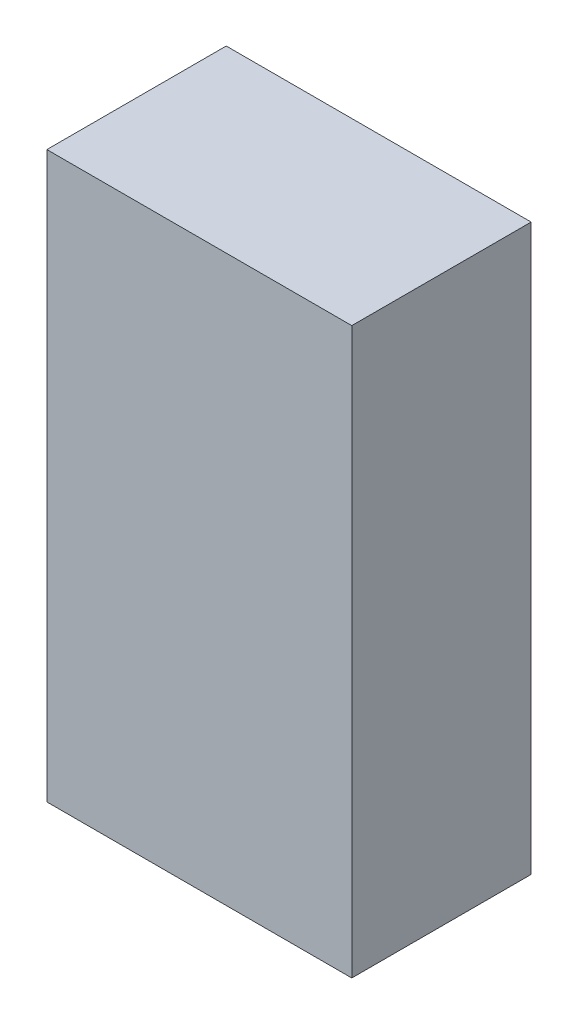
ISO-10303-21;
HEADER;
FILE_DESCRIPTION(('STEP AP214'),'2;1');
FILE_NAME('part.step','',(''),(''),'','','');
FILE_SCHEMA(('AUTOMOTIVE_DESIGN { 1 0 10303 214 1 1 1 1 }'));
ENDSEC;
DATA;
#1=APPLICATION_CONTEXT('core data for automotive mechanical design processes');
#2=APPLICATION_PROTOCOL_DEFINITION('international standard','automotive_design',2000,#1);
#3=PRODUCT_CONTEXT('',#1,'mechanical');
#4=PRODUCT('Part','Part','',(#3));
#5=PRODUCT_RELATED_PRODUCT_CATEGORY('part','',(#4));
#6=PRODUCT_DEFINITION_FORMATION('','',#4);
#7=PRODUCT_DEFINITION_CONTEXT('part definition',#1,'design');
#8=PRODUCT_DEFINITION('design','',#6,#7);
#9=PRODUCT_DEFINITION_SHAPE('','',#8);
#10=(LENGTH_UNIT() NAMED_UNIT(*) SI_UNIT(.MILLI.,.METRE.));
#11=(NAMED_UNIT(*) PLANE_ANGLE_UNIT() SI_UNIT($,.RADIAN.));
#12=(NAMED_UNIT(*) SI_UNIT($,.STERADIAN.) SOLID_ANGLE_UNIT());
#13=UNCERTAINTY_MEASURE_WITH_UNIT(LENGTH_MEASURE(1.E-05),#10,'distance_accuracy_value','');
#14=(GEOMETRIC_REPRESENTATION_CONTEXT(3) GLOBAL_UNCERTAINTY_ASSIGNED_CONTEXT((#13)) GLOBAL_UNIT_ASSIGNED_CONTEXT((#10,
#11,#12)) REPRESENTATION_CONTEXT('',''));
#15=CARTESIAN_POINT('',(0.,0.,0.));
#16=DIRECTION('',(0.,0.,1.));
#17=DIRECTION('',(1.,0.,0.));
#18=AXIS2_PLACEMENT_3D('',#15,#16,#17);
#19=CARTESIAN_POINT('',(-0.42500042,0.7875016,0.499999));
#20=DIRECTION('',(0.,0.,1.));
#21=DIRECTION('',(1.,0.,0.));
#22=AXIS2_PLACEMENT_3D('',#19,#20,#21);
#23=PLANE('',#22);
#24=DIRECTION('',(0.,1.,0.));
#25=VECTOR('',#24,1.);
#26=CARTESIAN_POINT('',(0.42500042,0.7875016,0.499999));
#27=LINE('',#26,#25);
#28=CARTESIAN_POINT('',(0.42500042,0.7875016,0.499999));
#29=VERTEX_POINT('',#28);
#30=CARTESIAN_POINT('',(0.42500042,-0.78749906,0.499999));
#31=VERTEX_POINT('',#30);
#32=EDGE_CURVE('E53',#29,#31,#27,.F.);
#33=ORIENTED_EDGE('',*,*,#32,.F.);
#34=DIRECTION('',(1.,0.,0.));
#35=VECTOR('',#34,1.);
#36=CARTESIAN_POINT('',(-0.42500042,0.7875016,0.499999));
#37=LINE('',#36,#35);
#38=CARTESIAN_POINT('',(-0.42500042,0.7875016,0.499999));
#39=VERTEX_POINT('',#38);
#40=EDGE_CURVE('E68',#39,#29,#37,.T.);
#41=ORIENTED_EDGE('',*,*,#40,.F.);
#42=DIRECTION('',(0.,1.,0.));
#43=VECTOR('',#42,1.);
#44=CARTESIAN_POINT('',(-0.42500042,-0.78749906,0.499999));
#45=LINE('',#44,#43);
#46=CARTESIAN_POINT('',(-0.42500042,-0.78749906,0.499999));
#47=VERTEX_POINT('',#46);
#48=EDGE_CURVE('E20',#47,#39,#45,.T.);
#49=ORIENTED_EDGE('',*,*,#48,.F.);
#50=DIRECTION('',(1.,0.,0.));
#51=VECTOR('',#50,1.);
#52=CARTESIAN_POINT('',(0.42500042,-0.78749906,0.499999));
#53=LINE('',#52,#51);
#54=EDGE_CURVE('E58',#31,#47,#53,.F.);
#55=ORIENTED_EDGE('',*,*,#54,.F.);
#56=EDGE_LOOP('',(#33,#41,#49,#55));
#57=FACE_BOUND('',#56,.T.);
#58=ADVANCED_FACE('F17',(#57),#23,.T.);
#59=CARTESIAN_POINT('',(-0.42500042,-0.78749906,0.));
#60=DIRECTION('',(-1.,0.,0.));
#61=DIRECTION('',(0.,0.,1.));
#62=AXIS2_PLACEMENT_3D('',#59,#60,#61);
#63=PLANE('',#62);
#64=DIRECTION('',(0.,0.,1.));
#65=VECTOR('',#64,1.);
#66=CARTESIAN_POINT('',(-0.42500042,0.7875016,0.));
#67=LINE('',#66,#65);
#68=CARTESIAN_POINT('',(-0.42500042,0.7875016,0.));
#69=VERTEX_POINT('',#68);
#70=EDGE_CURVE('E79',#69,#39,#67,.T.);
#71=ORIENTED_EDGE('',*,*,#70,.F.);
#72=DIRECTION('',(0.,1.,0.));
#73=VECTOR('',#72,1.);
#74=CARTESIAN_POINT('',(-0.42500042,0.7875016,0.));
#75=LINE('',#74,#73);
#76=CARTESIAN_POINT('',(-0.42500042,-0.78749906,0.));
#77=VERTEX_POINT('',#76);
#78=EDGE_CURVE('E74',#69,#77,#75,.F.);
#79=ORIENTED_EDGE('',*,*,#78,.T.);
#80=DIRECTION('',(0.,0.,-1.));
#81=VECTOR('',#80,1.);
#82=CARTESIAN_POINT('',(-0.42500042,-0.78749906,0.));
#83=LINE('',#82,#81);
#84=EDGE_CURVE('E63',#47,#77,#83,.T.);
#85=ORIENTED_EDGE('',*,*,#84,.F.);
#86=ORIENTED_EDGE('',*,*,#48,.T.);
#87=EDGE_LOOP('',(#71,#79,#85,#86));
#88=FACE_BOUND('',#87,.T.);
#89=ADVANCED_FACE('F73',(#88),#63,.T.);
#90=CARTESIAN_POINT('',(0.42500042,-0.78749906,0.));
#91=DIRECTION('',(0.,-1.,0.));
#92=DIRECTION('',(0.,0.,-1.));
#93=AXIS2_PLACEMENT_3D('',#90,#91,#92);
#94=PLANE('',#93);
#95=ORIENTED_EDGE('',*,*,#84,.T.);
#96=DIRECTION('',(1.,0.,0.));
#97=VECTOR('',#96,1.);
#98=CARTESIAN_POINT('',(-0.42500042,-0.78749906,0.));
#99=LINE('',#98,#97);
#100=CARTESIAN_POINT('',(0.42500042,-0.78749906,0.));
#101=VERTEX_POINT('',#100);
#102=EDGE_CURVE('E84',#77,#101,#99,.T.);
#103=ORIENTED_EDGE('',*,*,#102,.T.);
#104=DIRECTION('',(0.,0.,-1.));
#105=VECTOR('',#104,1.);
#106=CARTESIAN_POINT('',(0.42500042,-0.78749906,0.));
#107=LINE('',#106,#105);
#108=EDGE_CURVE('E65',#31,#101,#107,.T.);
#109=ORIENTED_EDGE('',*,*,#108,.F.);
#110=ORIENTED_EDGE('',*,*,#54,.T.);
#111=EDGE_LOOP('',(#95,#103,#109,#110));
#112=FACE_BOUND('',#111,.T.);
#113=ADVANCED_FACE('F60',(#112),#94,.T.);
#114=CARTESIAN_POINT('',(0.42500042,0.7875016,0.));
#115=DIRECTION('',(1.,0.,0.));
#116=DIRECTION('',(0.,0.,-1.));
#117=AXIS2_PLACEMENT_3D('',#114,#115,#116);
#118=PLANE('',#117);
#119=ORIENTED_EDGE('',*,*,#108,.T.);
#120=DIRECTION('',(0.,1.,0.));
#121=VECTOR('',#120,1.);
#122=CARTESIAN_POINT('',(0.42500042,0.7875016,0.));
#123=LINE('',#122,#121);
#124=CARTESIAN_POINT('',(0.42500042,0.7875016,0.));
#125=VERTEX_POINT('',#124);
#126=EDGE_CURVE('E26',#101,#125,#123,.T.);
#127=ORIENTED_EDGE('',*,*,#126,.T.);
#128=DIRECTION('',(0.,0.,1.));
#129=VECTOR('',#128,1.);
#130=CARTESIAN_POINT('',(0.42500042,0.7875016,0.));
#131=LINE('',#130,#129);
#132=EDGE_CURVE('E34',#29,#125,#131,.F.);
#133=ORIENTED_EDGE('',*,*,#132,.F.);
#134=ORIENTED_EDGE('',*,*,#32,.T.);
#135=EDGE_LOOP('',(#119,#127,#133,#134));
#136=FACE_BOUND('',#135,.T.);
#137=ADVANCED_FACE('F88',(#136),#118,.T.);
#138=CARTESIAN_POINT('',(-0.42500042,0.7875016,0.));
#139=DIRECTION('',(0.,1.,0.));
#140=DIRECTION('',(0.,0.,1.));
#141=AXIS2_PLACEMENT_3D('',#138,#139,#140);
#142=PLANE('',#141);
#143=ORIENTED_EDGE('',*,*,#132,.T.);
#144=DIRECTION('',(1.,0.,0.));
#145=VECTOR('',#144,1.);
#146=CARTESIAN_POINT('',(-0.42500042,0.7875016,0.));
#147=LINE('',#146,#145);
#148=EDGE_CURVE('E11',#125,#69,#147,.F.);
#149=ORIENTED_EDGE('',*,*,#148,.T.);
#150=ORIENTED_EDGE('',*,*,#70,.T.);
#151=ORIENTED_EDGE('',*,*,#40,.T.);
#152=EDGE_LOOP('',(#143,#149,#150,#151));
#153=FACE_BOUND('',#152,.T.);
#154=ADVANCED_FACE('F91',(#153),#142,.T.);
#155=CARTESIAN_POINT('',(-0.42500042,0.7875016,0.));
#156=DIRECTION('',(0.,0.,1.));
#157=DIRECTION('',(1.,0.,0.));
#158=AXIS2_PLACEMENT_3D('',#155,#156,#157);
#159=PLANE('',#158);
#160=ORIENTED_EDGE('',*,*,#126,.F.);
#161=ORIENTED_EDGE('',*,*,#102,.F.);
#162=ORIENTED_EDGE('',*,*,#78,.F.);
#163=ORIENTED_EDGE('',*,*,#148,.F.);
#164=EDGE_LOOP('',(#160,#161,#162,#163));
#165=FACE_BOUND('',#164,.T.);
#166=ADVANCED_FACE('F90',(#165),#159,.F.);
#167=CLOSED_SHELL('',(#58,#89,#113,#137,#154,#166));
#168=MANIFOLD_SOLID_BREP('B1',#167);
#169=ADVANCED_BREP_SHAPE_REPRESENTATION('',(#18,#168),#14);
#170=SHAPE_DEFINITION_REPRESENTATION(#9,#169);
ENDSEC;
END-ISO-10303-21;
